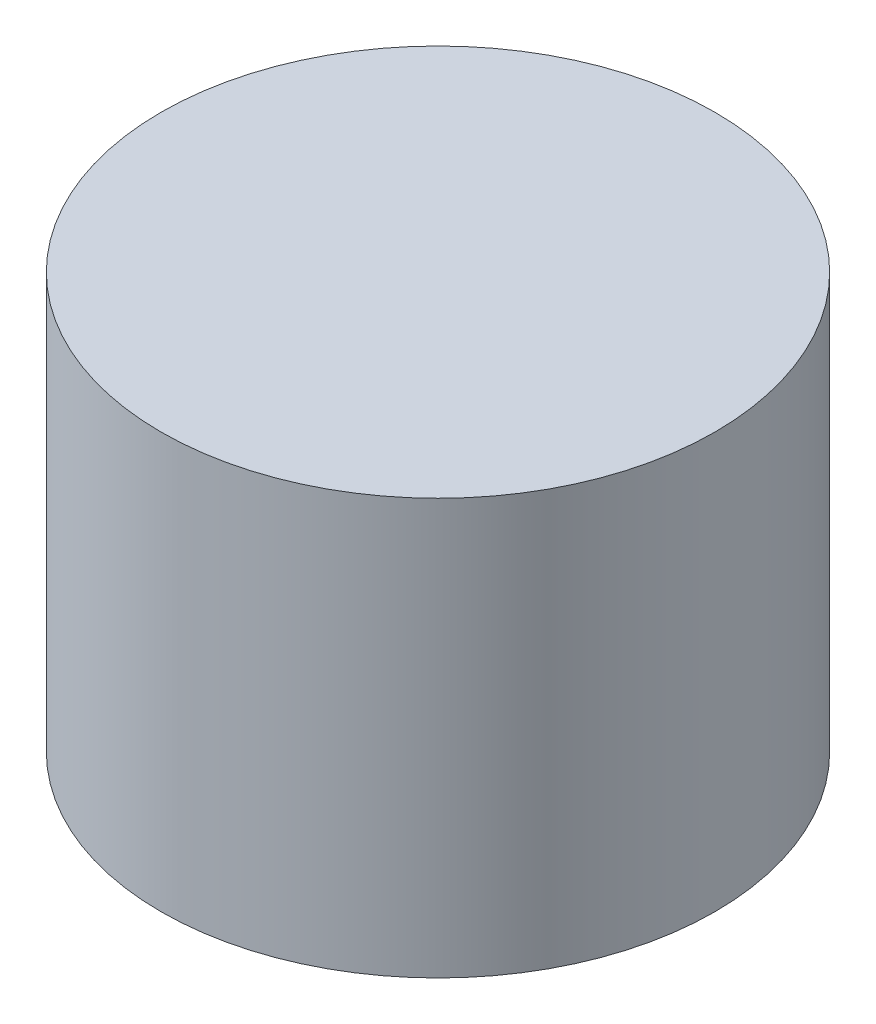
ISO-10303-21;
HEADER;
FILE_DESCRIPTION(('STEP AP214'),'2;1');
FILE_NAME('part.step','',(''),(''),'','','');
FILE_SCHEMA(('AUTOMOTIVE_DESIGN { 1 0 10303 214 1 1 1 1 }'));
ENDSEC;
DATA;
#1=APPLICATION_CONTEXT('core data for automotive mechanical design processes');
#2=APPLICATION_PROTOCOL_DEFINITION('international standard','automotive_design',2000,#1);
#3=PRODUCT_CONTEXT('',#1,'mechanical');
#4=PRODUCT('Part','Part','',(#3));
#5=PRODUCT_RELATED_PRODUCT_CATEGORY('part','',(#4));
#6=PRODUCT_DEFINITION_FORMATION('','',#4);
#7=PRODUCT_DEFINITION_CONTEXT('part definition',#1,'design');
#8=PRODUCT_DEFINITION('design','',#6,#7);
#9=PRODUCT_DEFINITION_SHAPE('','',#8);
#10=(LENGTH_UNIT() NAMED_UNIT(*) SI_UNIT(.MILLI.,.METRE.));
#11=(NAMED_UNIT(*) PLANE_ANGLE_UNIT() SI_UNIT($,.RADIAN.));
#12=(NAMED_UNIT(*) SI_UNIT($,.STERADIAN.) SOLID_ANGLE_UNIT());
#13=UNCERTAINTY_MEASURE_WITH_UNIT(LENGTH_MEASURE(1.E-05),#10,'distance_accuracy_value','');
#14=(GEOMETRIC_REPRESENTATION_CONTEXT(3) GLOBAL_UNCERTAINTY_ASSIGNED_CONTEXT((#13)) GLOBAL_UNIT_ASSIGNED_CONTEXT((#10,
#11,#12)) REPRESENTATION_CONTEXT('',''));
#15=CARTESIAN_POINT('',(0.,0.,0.));
#16=DIRECTION('',(0.,0.,1.));
#17=DIRECTION('',(1.,0.,0.));
#18=AXIS2_PLACEMENT_3D('',#15,#16,#17);
#19=CARTESIAN_POINT('',(0.,60.,0.));
#20=DIRECTION('',(0.,-1.,0.));
#21=DIRECTION('',(0.,0.,-1.));
#22=AXIS2_PLACEMENT_3D('',#19,#20,#21);
#23=CYLINDRICAL_SURFACE('',#22,40.);
#24=CARTESIAN_POINT('',(0.,60.,0.));
#25=DIRECTION('',(0.,1.,0.));
#26=DIRECTION('',(0.,0.,1.));
#27=AXIS2_PLACEMENT_3D('',#24,#25,#26);
#28=CIRCLE('',#27,40.);
#29=CARTESIAN_POINT('',(0.,60.,40.));
#30=VERTEX_POINT('',#29);
#31=EDGE_CURVE('E10',#30,#30,#28,.T.);
#32=ORIENTED_EDGE('',*,*,#31,.F.);
#33=EDGE_LOOP('',(#32));
#34=FACE_BOUND('',#33,.T.);
#35=CARTESIAN_POINT('',(0.,0.,0.));
#36=DIRECTION('',(0.,1.,0.));
#37=DIRECTION('',(0.,0.,1.));
#38=AXIS2_PLACEMENT_3D('',#35,#36,#37);
#39=CIRCLE('',#38,40.);
#40=CARTESIAN_POINT('',(0.,0.,40.));
#41=VERTEX_POINT('',#40);
#42=EDGE_CURVE('E34',#41,#41,#39,.T.);
#43=ORIENTED_EDGE('',*,*,#42,.T.);
#44=EDGE_LOOP('',(#43));
#45=FACE_BOUND('',#44,.T.);
#46=ADVANCED_FACE('F31',(#34,#45),#23,.T.);
#47=CARTESIAN_POINT('',(0.,60.,0.));
#48=DIRECTION('',(0.,1.,0.));
#49=DIRECTION('',(0.,0.,1.));
#50=AXIS2_PLACEMENT_3D('',#47,#48,#49);
#51=PLANE('',#50);
#52=ORIENTED_EDGE('',*,*,#31,.T.);
#53=EDGE_LOOP('',(#52));
#54=FACE_BOUND('',#53,.T.);
#55=ADVANCED_FACE('F46',(#54),#51,.T.);
#56=CARTESIAN_POINT('',(0.,0.,0.));
#57=DIRECTION('',(0.,1.,0.));
#58=DIRECTION('',(0.,0.,1.));
#59=AXIS2_PLACEMENT_3D('',#56,#57,#58);
#60=PLANE('',#59);
#61=ORIENTED_EDGE('',*,*,#42,.F.);
#62=EDGE_LOOP('',(#61));
#63=FACE_BOUND('',#62,.T.);
#64=ADVANCED_FACE('F44',(#63),#60,.F.);
#65=CLOSED_SHELL('',(#46,#55,#64));
#66=MANIFOLD_SOLID_BREP('B2',#65);
#67=ADVANCED_BREP_SHAPE_REPRESENTATION('',(#18,#66),#14);
#68=SHAPE_DEFINITION_REPRESENTATION(#9,#67);
ENDSEC;
END-ISO-10303-21;
